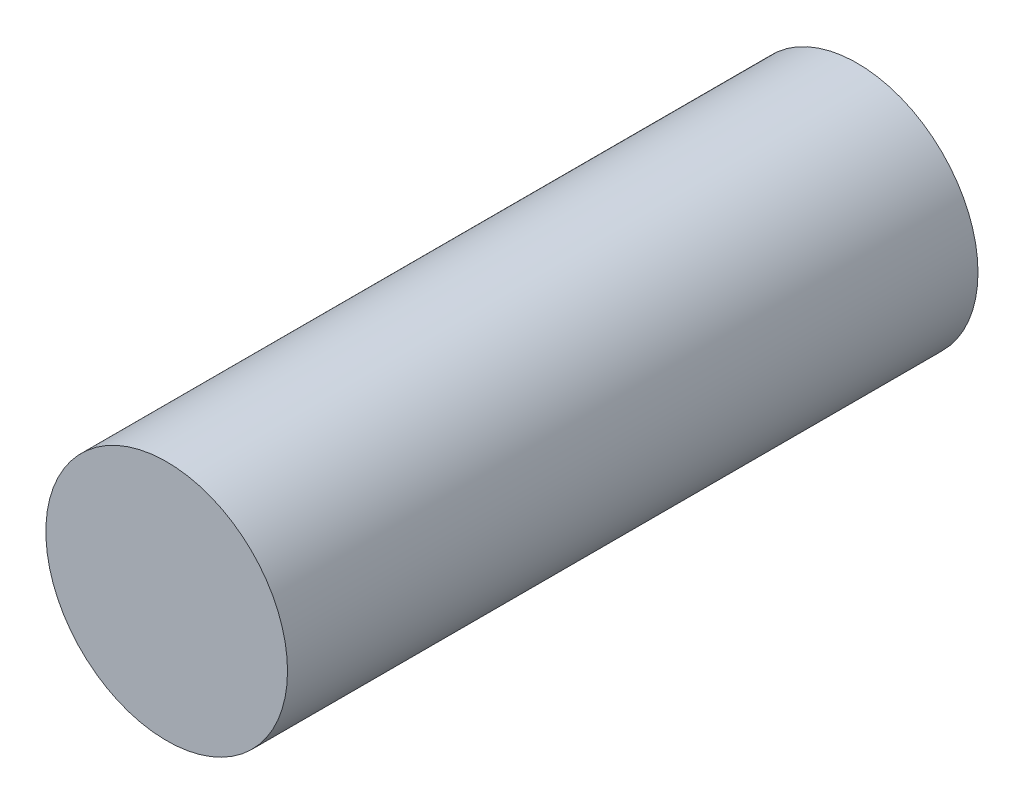
ISO-10303-21;
HEADER;
FILE_DESCRIPTION(('STEP AP214'),'2;1');
FILE_NAME('part.step','',(''),(''),'','','');
FILE_SCHEMA(('AUTOMOTIVE_DESIGN { 1 0 10303 214 1 1 1 1 }'));
ENDSEC;
DATA;
#1=APPLICATION_CONTEXT('core data for automotive mechanical design processes');
#2=APPLICATION_PROTOCOL_DEFINITION('international standard','automotive_design',2000,#1);
#3=PRODUCT_CONTEXT('',#1,'mechanical');
#4=PRODUCT('Part','Part','',(#3));
#5=PRODUCT_RELATED_PRODUCT_CATEGORY('part','',(#4));
#6=PRODUCT_DEFINITION_FORMATION('','',#4);
#7=PRODUCT_DEFINITION_CONTEXT('part definition',#1,'design');
#8=PRODUCT_DEFINITION('design','',#6,#7);
#9=PRODUCT_DEFINITION_SHAPE('','',#8);
#10=(LENGTH_UNIT() NAMED_UNIT(*) SI_UNIT(.MILLI.,.METRE.));
#11=(NAMED_UNIT(*) PLANE_ANGLE_UNIT() SI_UNIT($,.RADIAN.));
#12=(NAMED_UNIT(*) SI_UNIT($,.STERADIAN.) SOLID_ANGLE_UNIT());
#13=UNCERTAINTY_MEASURE_WITH_UNIT(LENGTH_MEASURE(1.E-05),#10,'distance_accuracy_value','');
#14=(GEOMETRIC_REPRESENTATION_CONTEXT(3) GLOBAL_UNCERTAINTY_ASSIGNED_CONTEXT((#13)) GLOBAL_UNIT_ASSIGNED_CONTEXT((#10,
#11,#12)) REPRESENTATION_CONTEXT('',''));
#15=CARTESIAN_POINT('',(0.,0.,0.));
#16=DIRECTION('',(0.,0.,1.));
#17=DIRECTION('',(1.,0.,0.));
#18=AXIS2_PLACEMENT_3D('',#15,#16,#17);
#19=CARTESIAN_POINT('',(-89.,222.,-20.));
#20=DIRECTION('',(0.,0.,1.));
#21=DIRECTION('',(1.,0.,0.));
#22=AXIS2_PLACEMENT_3D('',#19,#20,#21);
#23=CYLINDRICAL_SURFACE('',#22,7.);
#24=CARTESIAN_POINT('',(-89.,222.,-20.));
#25=DIRECTION('',(0.,0.,1.));
#26=DIRECTION('',(1.,0.,0.));
#27=AXIS2_PLACEMENT_3D('',#24,#25,#26);
#28=CIRCLE('',#27,7.);
#29=CARTESIAN_POINT('',(-82.,222.,-20.));
#30=VERTEX_POINT('',#29);
#31=EDGE_CURVE('E10',#30,#30,#28,.T.);
#32=ORIENTED_EDGE('',*,*,#31,.T.);
#33=EDGE_LOOP('',(#32));
#34=FACE_BOUND('',#33,.T.);
#35=CARTESIAN_POINT('',(-89.,222.,20.));
#36=DIRECTION('',(0.,0.,1.));
#37=DIRECTION('',(1.,0.,0.));
#38=AXIS2_PLACEMENT_3D('',#35,#36,#37);
#39=CIRCLE('',#38,7.);
#40=CARTESIAN_POINT('',(-82.,222.,20.));
#41=VERTEX_POINT('',#40);
#42=EDGE_CURVE('E40',#41,#41,#39,.T.);
#43=ORIENTED_EDGE('',*,*,#42,.F.);
#44=EDGE_LOOP('',(#43));
#45=FACE_BOUND('',#44,.T.);
#46=ADVANCED_FACE('F37',(#34,#45),#23,.T.);
#47=CARTESIAN_POINT('',(-89.,222.,-20.));
#48=DIRECTION('',(0.,0.,1.));
#49=DIRECTION('',(1.,0.,0.));
#50=AXIS2_PLACEMENT_3D('',#47,#48,#49);
#51=PLANE('',#50);
#52=ORIENTED_EDGE('',*,*,#31,.F.);
#53=EDGE_LOOP('',(#52));
#54=FACE_BOUND('',#53,.T.);
#55=ADVANCED_FACE('F52',(#54),#51,.F.);
#56=CARTESIAN_POINT('',(-89.,222.,20.));
#57=DIRECTION('',(0.,0.,1.));
#58=DIRECTION('',(1.,0.,0.));
#59=AXIS2_PLACEMENT_3D('',#56,#57,#58);
#60=PLANE('',#59);
#61=ORIENTED_EDGE('',*,*,#42,.T.);
#62=EDGE_LOOP('',(#61));
#63=FACE_BOUND('',#62,.T.);
#64=ADVANCED_FACE('F49',(#63),#60,.T.);
#65=CLOSED_SHELL('',(#46,#55,#64));
#66=MANIFOLD_SOLID_BREP('B2',#65);
#67=ADVANCED_BREP_SHAPE_REPRESENTATION('',(#18,#66),#14);
#68=SHAPE_DEFINITION_REPRESENTATION(#9,#67);
ENDSEC;
END-ISO-10303-21;
